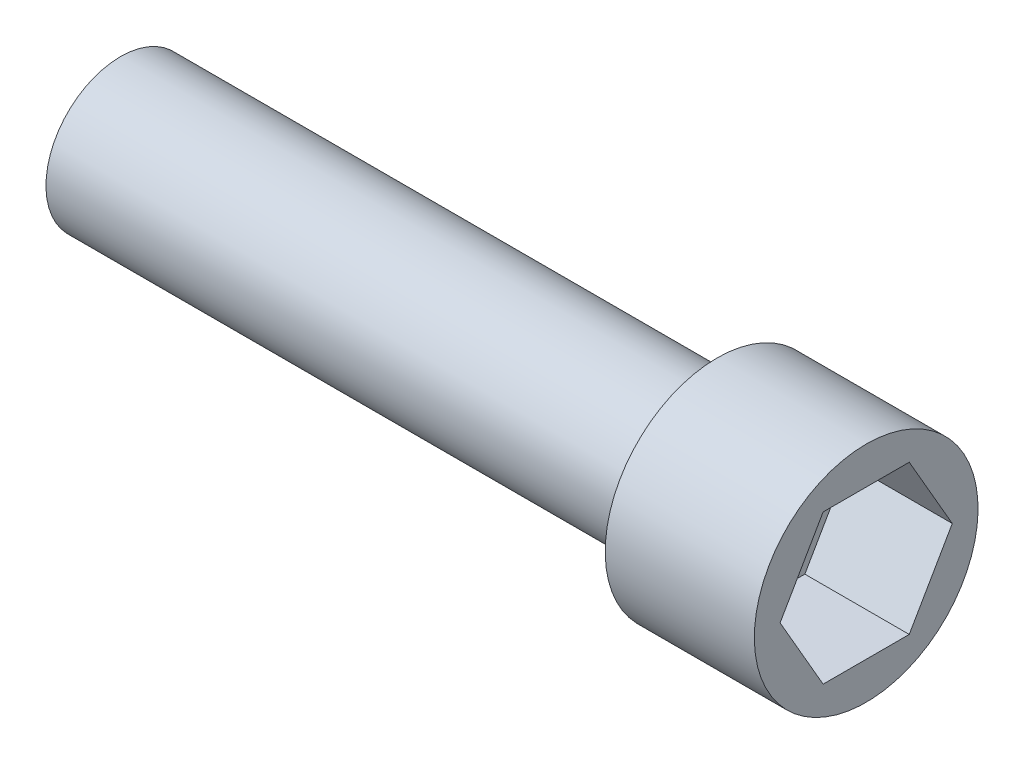
ISO-10303-21;
HEADER;
FILE_DESCRIPTION(('STEP AP214'),'2;1');
FILE_NAME('part.step','',(''),(''),'','','');
FILE_SCHEMA(('AUTOMOTIVE_DESIGN { 1 0 10303 214 1 1 1 1 }'));
ENDSEC;
DATA;
#1=APPLICATION_CONTEXT('core data for automotive mechanical design processes');
#2=APPLICATION_PROTOCOL_DEFINITION('international standard','automotive_design',2000,#1);
#3=PRODUCT_CONTEXT('',#1,'mechanical');
#4=PRODUCT('Part','Part','',(#3));
#5=PRODUCT_RELATED_PRODUCT_CATEGORY('part','',(#4));
#6=PRODUCT_DEFINITION_FORMATION('','',#4);
#7=PRODUCT_DEFINITION_CONTEXT('part definition',#1,'design');
#8=PRODUCT_DEFINITION('design','',#6,#7);
#9=PRODUCT_DEFINITION_SHAPE('','',#8);
#10=(LENGTH_UNIT() NAMED_UNIT(*) SI_UNIT(.MILLI.,.METRE.));
#11=(NAMED_UNIT(*) PLANE_ANGLE_UNIT() SI_UNIT($,.RADIAN.));
#12=(NAMED_UNIT(*) SI_UNIT($,.STERADIAN.) SOLID_ANGLE_UNIT());
#13=UNCERTAINTY_MEASURE_WITH_UNIT(LENGTH_MEASURE(1.E-05),#10,'distance_accuracy_value','');
#14=(GEOMETRIC_REPRESENTATION_CONTEXT(3) GLOBAL_UNCERTAINTY_ASSIGNED_CONTEXT((#13)) GLOBAL_UNIT_ASSIGNED_CONTEXT((#10,
#11,#12)) REPRESENTATION_CONTEXT('',''));
#15=CARTESIAN_POINT('',(0.,0.,0.));
#16=DIRECTION('',(0.,0.,1.));
#17=DIRECTION('',(1.,0.,0.));
#18=AXIS2_PLACEMENT_3D('',#15,#16,#17);
#19=CARTESIAN_POINT('',(-25.,0.,0.));
#20=DIRECTION('',(-1.,0.,0.));
#21=DIRECTION('',(0.,-1.,0.));
#22=AXIS2_PLACEMENT_3D('',#19,#20,#21);
#23=PLANE('',#22);
#24=CARTESIAN_POINT('',(-25.,0.,0.));
#25=DIRECTION('',(1.,0.,0.));
#26=DIRECTION('',(0.,1.,0.));
#27=AXIS2_PLACEMENT_3D('',#24,#25,#26);
#28=CIRCLE('',#27,5.);
#29=CARTESIAN_POINT('',(-25.,4.99999999999999,0.));
#30=VERTEX_POINT('',#29);
#31=EDGE_CURVE('E11',#30,#30,#28,.T.);
#32=ORIENTED_EDGE('',*,*,#31,.F.);
#33=EDGE_LOOP('',(#32));
#34=FACE_BOUND('',#33,.T.);
#35=ADVANCED_FACE('F43',(#34),#23,.T.);
#36=CARTESIAN_POINT('',(25.,0.,0.));
#37=DIRECTION('',(1.,0.,0.));
#38=DIRECTION('',(0.,1.,0.));
#39=AXIS2_PLACEMENT_3D('',#36,#37,#38);
#40=CYLINDRICAL_SURFACE('',#39,5.);
#41=ORIENTED_EDGE('',*,*,#31,.T.);
#42=EDGE_LOOP('',(#41));
#43=FACE_BOUND('',#42,.T.);
#44=CARTESIAN_POINT('',(15.,0.,0.));
#45=DIRECTION('',(1.,0.,0.));
#46=DIRECTION('',(0.,1.,0.));
#47=AXIS2_PLACEMENT_3D('',#44,#45,#46);
#48=CIRCLE('',#47,4.99999999999999);
#49=CARTESIAN_POINT('',(15.,4.99999999999999,0.));
#50=VERTEX_POINT('',#49);
#51=EDGE_CURVE('E51',#50,#50,#48,.T.);
#52=ORIENTED_EDGE('',*,*,#51,.F.);
#53=EDGE_LOOP('',(#52));
#54=FACE_BOUND('',#53,.T.);
#55=ADVANCED_FACE('F180',(#43,#54),#40,.T.);
#56=CARTESIAN_POINT('',(15.,4.99999999999999,0.));
#57=DIRECTION('',(-1.,0.,0.));
#58=DIRECTION('',(0.,-1.,0.));
#59=AXIS2_PLACEMENT_3D('',#56,#57,#58);
#60=PLANE('',#59);
#61=ORIENTED_EDGE('',*,*,#51,.T.);
#62=EDGE_LOOP('',(#61));
#63=FACE_BOUND('',#62,.T.);
#64=CARTESIAN_POINT('',(15.,0.,0.));
#65=DIRECTION('',(1.,0.,0.));
#66=DIRECTION('',(0.,1.,0.));
#67=AXIS2_PLACEMENT_3D('',#64,#65,#66);
#68=CIRCLE('',#67,7.5);
#69=CARTESIAN_POINT('',(15.,7.49999999999999,0.));
#70=VERTEX_POINT('',#69);
#71=EDGE_CURVE('E170',#70,#70,#68,.T.);
#72=ORIENTED_EDGE('',*,*,#71,.F.);
#73=EDGE_LOOP('',(#72));
#74=FACE_BOUND('',#73,.T.);
#75=ADVANCED_FACE('F177',(#63,#74),#60,.T.);
#76=CARTESIAN_POINT('',(25.,0.,0.));
#77=DIRECTION('',(1.,0.,0.));
#78=DIRECTION('',(0.,1.,0.));
#79=AXIS2_PLACEMENT_3D('',#76,#77,#78);
#80=CYLINDRICAL_SURFACE('',#79,7.49999999999999);
#81=ORIENTED_EDGE('',*,*,#71,.T.);
#82=EDGE_LOOP('',(#81));
#83=FACE_BOUND('',#82,.T.);
#84=CARTESIAN_POINT('',(25.,0.,0.));
#85=DIRECTION('',(1.,0.,0.));
#86=DIRECTION('',(0.,1.,0.));
#87=AXIS2_PLACEMENT_3D('',#84,#85,#86);
#88=CIRCLE('',#87,7.49999999999999);
#89=CARTESIAN_POINT('',(25.,7.49999999999999,0.));
#90=VERTEX_POINT('',#89);
#91=EDGE_CURVE('E157',#90,#90,#88,.T.);
#92=ORIENTED_EDGE('',*,*,#91,.F.);
#93=EDGE_LOOP('',(#92));
#94=FACE_BOUND('',#93,.T.);
#95=ADVANCED_FACE('F187',(#83,#94),#80,.T.);
#96=CARTESIAN_POINT('',(25.,7.49999999999999,0.));
#97=DIRECTION('',(1.,0.,0.));
#98=DIRECTION('',(0.,1.,0.));
#99=AXIS2_PLACEMENT_3D('',#96,#97,#98);
#100=PLANE('',#99);
#101=DIRECTION('',(0.,0.866025403784439,-0.5));
#102=VECTOR('',#101,1.);
#103=CARTESIAN_POINT('',(25.,-5.,-2.88675134594813));
#104=LINE('',#103,#102);
#105=CARTESIAN_POINT('',(25.,-5.,-2.88675134594813));
#106=VERTEX_POINT('',#105);
#107=CARTESIAN_POINT('',(25.,0.,-5.77350269189626));
#108=VERTEX_POINT('',#107);
#109=EDGE_CURVE('E58',#106,#108,#104,.T.);
#110=ORIENTED_EDGE('',*,*,#109,.F.);
#111=DIRECTION('',(0.,0.,-1.));
#112=VECTOR('',#111,1.);
#113=CARTESIAN_POINT('',(25.,-5.,2.88675134594813));
#114=LINE('',#113,#112);
#115=CARTESIAN_POINT('',(25.,-5.,2.88675134594813));
#116=VERTEX_POINT('',#115);
#117=EDGE_CURVE('E151',#116,#106,#114,.T.);
#118=ORIENTED_EDGE('',*,*,#117,.F.);
#119=DIRECTION('',(0.,-0.866025403784438,-0.5));
#120=VECTOR('',#119,1.);
#121=CARTESIAN_POINT('',(25.,0.,5.77350269189626));
#122=LINE('',#121,#120);
#123=CARTESIAN_POINT('',(25.,0.,5.77350269189626));
#124=VERTEX_POINT('',#123);
#125=EDGE_CURVE('E148',#124,#116,#122,.T.);
#126=ORIENTED_EDGE('',*,*,#125,.F.);
#127=DIRECTION('',(0.,-0.866025403784439,0.5));
#128=VECTOR('',#127,1.);
#129=CARTESIAN_POINT('',(25.,5.,2.88675134594813));
#130=LINE('',#129,#128);
#131=CARTESIAN_POINT('',(25.,5.,2.88675134594813));
#132=VERTEX_POINT('',#131);
#133=EDGE_CURVE('E106',#132,#124,#130,.T.);
#134=ORIENTED_EDGE('',*,*,#133,.F.);
#135=DIRECTION('',(0.,0.,1.));
#136=VECTOR('',#135,1.);
#137=CARTESIAN_POINT('',(25.,5.,-2.88675134594813));
#138=LINE('',#137,#136);
#139=CARTESIAN_POINT('',(25.,5.,-2.88675134594813));
#140=VERTEX_POINT('',#139);
#141=EDGE_CURVE('E142',#140,#132,#138,.T.);
#142=ORIENTED_EDGE('',*,*,#141,.F.);
#143=DIRECTION('',(0.,0.866025403784438,0.5));
#144=VECTOR('',#143,1.);
#145=CARTESIAN_POINT('',(25.,0.,-5.77350269189626));
#146=LINE('',#145,#144);
#147=EDGE_CURVE('E138',#108,#140,#146,.T.);
#148=ORIENTED_EDGE('',*,*,#147,.F.);
#149=EDGE_LOOP('',(#110,#118,#126,#134,#142,#148));
#150=FACE_BOUND('',#149,.T.);
#151=ORIENTED_EDGE('',*,*,#91,.T.);
#152=EDGE_LOOP('',(#151));
#153=FACE_BOUND('',#152,.T.);
#154=ADVANCED_FACE('F193',(#150,#153),#100,.T.);
#155=CARTESIAN_POINT('',(18.,-5.,-2.88675134594813));
#156=DIRECTION('',(0.,-0.5,-0.866025403784439));
#157=DIRECTION('',(0.,0.866025403784439,-0.5));
#158=AXIS2_PLACEMENT_3D('',#155,#156,#157);
#159=PLANE('',#158);
#160=ORIENTED_EDGE('',*,*,#109,.T.);
#161=DIRECTION('',(1.,0.,0.));
#162=VECTOR('',#161,1.);
#163=CARTESIAN_POINT('',(18.,0.,-5.77350269189626));
#164=LINE('',#163,#162);
#165=CARTESIAN_POINT('',(18.,0.,-5.77350269189626));
#166=VERTEX_POINT('',#165);
#167=EDGE_CURVE('E88',#166,#108,#164,.T.);
#168=ORIENTED_EDGE('',*,*,#167,.F.);
#169=DIRECTION('',(0.,0.866025403784439,-0.5));
#170=VECTOR('',#169,1.);
#171=CARTESIAN_POINT('',(18.,-5.,-2.88675134594813));
#172=LINE('',#171,#170);
#173=CARTESIAN_POINT('',(18.,-5.,-2.88675134594813));
#174=VERTEX_POINT('',#173);
#175=EDGE_CURVE('E154',#174,#166,#172,.T.);
#176=ORIENTED_EDGE('',*,*,#175,.F.);
#177=DIRECTION('',(1.,0.,0.));
#178=VECTOR('',#177,1.);
#179=CARTESIAN_POINT('',(18.,-5.,-2.88675134594813));
#180=LINE('',#179,#178);
#181=EDGE_CURVE('E66',#174,#106,#180,.T.);
#182=ORIENTED_EDGE('',*,*,#181,.T.);
#183=EDGE_LOOP('',(#160,#168,#176,#182));
#184=FACE_BOUND('',#183,.T.);
#185=ADVANCED_FACE('F197',(#184),#159,.F.);
#186=CARTESIAN_POINT('',(18.,-5.,2.88675134594813));
#187=DIRECTION('',(0.,-1.,0.));
#188=DIRECTION('',(0.,0.,-1.));
#189=AXIS2_PLACEMENT_3D('',#186,#187,#188);
#190=PLANE('',#189);
#191=ORIENTED_EDGE('',*,*,#117,.T.);
#192=ORIENTED_EDGE('',*,*,#181,.F.);
#193=DIRECTION('',(0.,0.,-1.));
#194=VECTOR('',#193,1.);
#195=CARTESIAN_POINT('',(18.,-5.,2.88675134594813));
#196=LINE('',#195,#194);
#197=CARTESIAN_POINT('',(18.,-5.,2.88675134594813));
#198=VERTEX_POINT('',#197);
#199=EDGE_CURVE('E120',#198,#174,#196,.T.);
#200=ORIENTED_EDGE('',*,*,#199,.F.);
#201=DIRECTION('',(1.,0.,0.));
#202=VECTOR('',#201,1.);
#203=CARTESIAN_POINT('',(18.,-5.,2.88675134594813));
#204=LINE('',#203,#202);
#205=EDGE_CURVE('E111',#198,#116,#204,.T.);
#206=ORIENTED_EDGE('',*,*,#205,.T.);
#207=EDGE_LOOP('',(#191,#192,#200,#206));
#208=FACE_BOUND('',#207,.T.);
#209=ADVANCED_FACE('F201',(#208),#190,.F.);
#210=CARTESIAN_POINT('',(18.,0.,5.77350269189626));
#211=DIRECTION('',(0.,-0.5,0.866025403784438));
#212=DIRECTION('',(0.,-0.866025403784438,-0.5));
#213=AXIS2_PLACEMENT_3D('',#210,#211,#212);
#214=PLANE('',#213);
#215=ORIENTED_EDGE('',*,*,#125,.T.);
#216=ORIENTED_EDGE('',*,*,#205,.F.);
#217=DIRECTION('',(0.,-0.866025403784438,-0.5));
#218=VECTOR('',#217,1.);
#219=CARTESIAN_POINT('',(18.,0.,5.77350269189626));
#220=LINE('',#219,#218);
#221=CARTESIAN_POINT('',(18.,0.,5.77350269189626));
#222=VERTEX_POINT('',#221);
#223=EDGE_CURVE('E115',#222,#198,#220,.T.);
#224=ORIENTED_EDGE('',*,*,#223,.F.);
#225=DIRECTION('',(1.,0.,0.));
#226=VECTOR('',#225,1.);
#227=CARTESIAN_POINT('',(18.,0.,5.77350269189626));
#228=LINE('',#227,#226);
#229=EDGE_CURVE('E99',#222,#124,#228,.T.);
#230=ORIENTED_EDGE('',*,*,#229,.T.);
#231=EDGE_LOOP('',(#215,#216,#224,#230));
#232=FACE_BOUND('',#231,.T.);
#233=ADVANCED_FACE('F116',(#232),#214,.F.);
#234=CARTESIAN_POINT('',(18.,5.,2.88675134594813));
#235=DIRECTION('',(0.,0.5,0.866025403784439));
#236=DIRECTION('',(0.,-0.866025403784439,0.5));
#237=AXIS2_PLACEMENT_3D('',#234,#235,#236);
#238=PLANE('',#237);
#239=ORIENTED_EDGE('',*,*,#133,.T.);
#240=ORIENTED_EDGE('',*,*,#229,.F.);
#241=DIRECTION('',(0.,-0.866025403784439,0.5));
#242=VECTOR('',#241,1.);
#243=CARTESIAN_POINT('',(18.,5.,2.88675134594813));
#244=LINE('',#243,#242);
#245=CARTESIAN_POINT('',(18.,5.,2.88675134594813));
#246=VERTEX_POINT('',#245);
#247=EDGE_CURVE('E103',#246,#222,#244,.T.);
#248=ORIENTED_EDGE('',*,*,#247,.F.);
#249=DIRECTION('',(1.,0.,0.));
#250=VECTOR('',#249,1.);
#251=CARTESIAN_POINT('',(18.,5.,2.88675134594813));
#252=LINE('',#251,#250);
#253=EDGE_CURVE('E112',#246,#132,#252,.T.);
#254=ORIENTED_EDGE('',*,*,#253,.T.);
#255=EDGE_LOOP('',(#239,#240,#248,#254));
#256=FACE_BOUND('',#255,.T.);
#257=ADVANCED_FACE('F101',(#256),#238,.F.);
#258=CARTESIAN_POINT('',(18.,5.,-2.88675134594813));
#259=DIRECTION('',(0.,1.,0.));
#260=DIRECTION('',(0.,0.,1.));
#261=AXIS2_PLACEMENT_3D('',#258,#259,#260);
#262=PLANE('',#261);
#263=ORIENTED_EDGE('',*,*,#141,.T.);
#264=ORIENTED_EDGE('',*,*,#253,.F.);
#265=DIRECTION('',(0.,0.,1.));
#266=VECTOR('',#265,1.);
#267=CARTESIAN_POINT('',(18.,5.,-2.88675134594813));
#268=LINE('',#267,#266);
#269=CARTESIAN_POINT('',(18.,5.,-2.88675134594813));
#270=VERTEX_POINT('',#269);
#271=EDGE_CURVE('E126',#270,#246,#268,.T.);
#272=ORIENTED_EDGE('',*,*,#271,.F.);
#273=DIRECTION('',(1.,0.,0.));
#274=VECTOR('',#273,1.);
#275=CARTESIAN_POINT('',(18.,5.,-2.88675134594813));
#276=LINE('',#275,#274);
#277=EDGE_CURVE('E162',#270,#140,#276,.T.);
#278=ORIENTED_EDGE('',*,*,#277,.T.);
#279=EDGE_LOOP('',(#263,#264,#272,#278));
#280=FACE_BOUND('',#279,.T.);
#281=ADVANCED_FACE('F205',(#280),#262,.F.);
#282=CARTESIAN_POINT('',(18.,0.,-5.77350269189626));
#283=DIRECTION('',(0.,0.5,-0.866025403784438));
#284=DIRECTION('',(0.,0.866025403784439,0.5));
#285=AXIS2_PLACEMENT_3D('',#282,#283,#284);
#286=PLANE('',#285);
#287=ORIENTED_EDGE('',*,*,#147,.T.);
#288=ORIENTED_EDGE('',*,*,#277,.F.);
#289=DIRECTION('',(0.,0.866025403784438,0.5));
#290=VECTOR('',#289,1.);
#291=CARTESIAN_POINT('',(18.,0.,-5.77350269189626));
#292=LINE('',#291,#290);
#293=EDGE_CURVE('E130',#166,#270,#292,.T.);
#294=ORIENTED_EDGE('',*,*,#293,.F.);
#295=ORIENTED_EDGE('',*,*,#167,.T.);
#296=EDGE_LOOP('',(#287,#288,#294,#295));
#297=FACE_BOUND('',#296,.T.);
#298=ADVANCED_FACE('F202',(#297),#286,.F.);
#299=CARTESIAN_POINT('',(18.,0.,0.));
#300=DIRECTION('',(1.,0.,0.));
#301=DIRECTION('',(0.,0.,-1.));
#302=AXIS2_PLACEMENT_3D('',#299,#300,#301);
#303=PLANE('',#302);
#304=ORIENTED_EDGE('',*,*,#175,.T.);
#305=ORIENTED_EDGE('',*,*,#293,.T.);
#306=ORIENTED_EDGE('',*,*,#271,.T.);
#307=ORIENTED_EDGE('',*,*,#247,.T.);
#308=ORIENTED_EDGE('',*,*,#223,.T.);
#309=ORIENTED_EDGE('',*,*,#199,.T.);
#310=EDGE_LOOP('',(#304,#305,#306,#307,#308,#309));
#311=FACE_BOUND('',#310,.T.);
#312=ADVANCED_FACE('F123',(#311),#303,.T.);
#313=CLOSED_SHELL('',(#35,#55,#75,#95,#154,#185,#209,#233,#257,#281,#298,#312));
#314=MANIFOLD_SOLID_BREP('B2',#313);
#315=ADVANCED_BREP_SHAPE_REPRESENTATION('',(#18,#314),#14);
#316=SHAPE_DEFINITION_REPRESENTATION(#9,#315);
ENDSEC;
END-ISO-10303-21;
